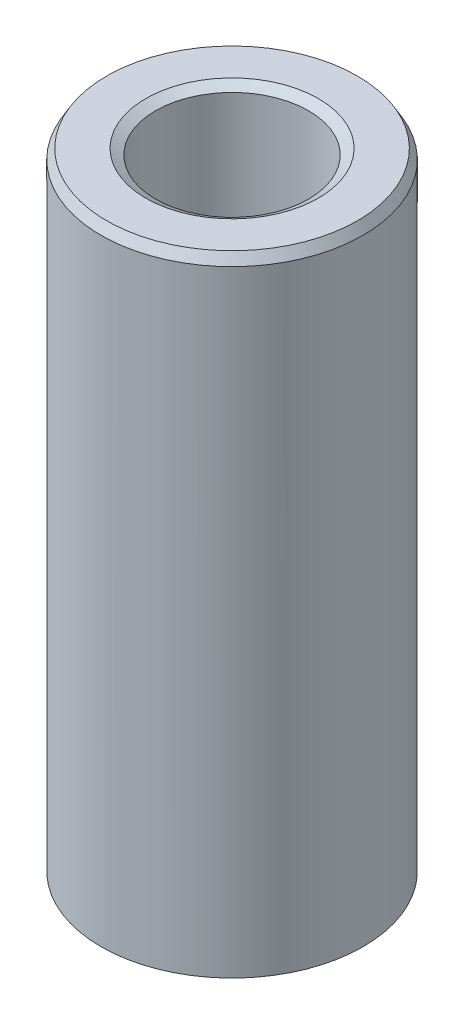
ISO-10303-21;
HEADER;
FILE_DESCRIPTION(('STEP AP214'),'2;1');
FILE_NAME('part.step','',(''),(''),'','','');
FILE_SCHEMA(('AUTOMOTIVE_DESIGN { 1 0 10303 214 1 1 1 1 }'));
ENDSEC;
DATA;
#1=APPLICATION_CONTEXT('core data for automotive mechanical design processes');
#2=APPLICATION_PROTOCOL_DEFINITION('international standard','automotive_design',2000,#1);
#3=PRODUCT_CONTEXT('',#1,'mechanical');
#4=PRODUCT('Part','Part','',(#3));
#5=PRODUCT_RELATED_PRODUCT_CATEGORY('part','',(#4));
#6=PRODUCT_DEFINITION_FORMATION('','',#4);
#7=PRODUCT_DEFINITION_CONTEXT('part definition',#1,'design');
#8=PRODUCT_DEFINITION('design','',#6,#7);
#9=PRODUCT_DEFINITION_SHAPE('','',#8);
#10=(LENGTH_UNIT() NAMED_UNIT(*) SI_UNIT(.MILLI.,.METRE.));
#11=(NAMED_UNIT(*) PLANE_ANGLE_UNIT() SI_UNIT($,.RADIAN.));
#12=(NAMED_UNIT(*) SI_UNIT($,.STERADIAN.) SOLID_ANGLE_UNIT());
#13=UNCERTAINTY_MEASURE_WITH_UNIT(LENGTH_MEASURE(1.E-05),#10,'distance_accuracy_value','');
#14=(GEOMETRIC_REPRESENTATION_CONTEXT(3) GLOBAL_UNCERTAINTY_ASSIGNED_CONTEXT((#13)) GLOBAL_UNIT_ASSIGNED_CONTEXT((#10,
#11,#12)) REPRESENTATION_CONTEXT('',''));
#15=CARTESIAN_POINT('',(0.,0.,0.));
#16=DIRECTION('',(0.,0.,1.));
#17=DIRECTION('',(1.,0.,0.));
#18=AXIS2_PLACEMENT_3D('',#15,#16,#17);
#19=CARTESIAN_POINT('',(0.,60.2453496191508,0.));
#20=DIRECTION('',(0.,-1.,0.));
#21=DIRECTION('',(0.,0.,-1.));
#22=AXIS2_PLACEMENT_3D('',#19,#20,#21);
#23=CYLINDRICAL_SURFACE('',#22,12.5);
#24=CARTESIAN_POINT('',(0.,0.538883833662865,0.));
#25=DIRECTION('',(0.,1.,0.));
#26=DIRECTION('',(0.,0.,1.));
#27=AXIS2_PLACEMENT_3D('',#24,#25,#26);
#28=CIRCLE('',#27,12.5);
#29=CARTESIAN_POINT('',(0.,0.538883833662865,12.5));
#30=VERTEX_POINT('',#29);
#31=EDGE_CURVE('E10',#30,#30,#28,.T.);
#32=ORIENTED_EDGE('',*,*,#31,.T.);
#33=EDGE_LOOP('',(#32));
#34=FACE_BOUND('',#33,.T.);
#35=CARTESIAN_POINT('',(0.,59.3119754398693,0.));
#36=DIRECTION('',(0.,1.,0.));
#37=DIRECTION('',(0.,0.,1.));
#38=AXIS2_PLACEMENT_3D('',#35,#36,#37);
#39=CIRCLE('',#38,12.5);
#40=CARTESIAN_POINT('',(0.,59.3119754398693,-12.5));
#41=VERTEX_POINT('',#40);
#42=EDGE_CURVE('E50',#41,#41,#39,.F.);
#43=ORIENTED_EDGE('',*,*,#42,.T.);
#44=EDGE_LOOP('',(#43));
#45=FACE_BOUND('',#44,.T.);
#46=ADVANCED_FACE('F39',(#34,#45),#23,.T.);
#47=CARTESIAN_POINT('',(0.,60.2453496191508,0.));
#48=DIRECTION('',(0.,1.,0.));
#49=DIRECTION('',(0.,0.,1.));
#50=AXIS2_PLACEMENT_3D('',#47,#48,#49);
#51=PLANE('',#50);
#52=CARTESIAN_POINT('',(0.,60.2453496191508,0.));
#53=DIRECTION('',(0.,1.,0.));
#54=DIRECTION('',(0.,0.,1.));
#55=AXIS2_PLACEMENT_3D('',#52,#53,#54);
#56=CIRCLE('',#55,8.2341659775638);
#57=CARTESIAN_POINT('',(0.,60.2453496191508,8.2341659775638));
#58=VERTEX_POINT('',#57);
#59=EDGE_CURVE('E58',#58,#58,#56,.F.);
#60=ORIENTED_EDGE('',*,*,#59,.T.);
#61=EDGE_LOOP('',(#60));
#62=FACE_BOUND('',#61,.T.);
#63=CARTESIAN_POINT('',(0.,60.2453496191508,0.));
#64=DIRECTION('',(0.,1.,0.));
#65=DIRECTION('',(0.,0.,1.));
#66=AXIS2_PLACEMENT_3D('',#63,#64,#65);
#67=CIRCLE('',#66,11.9611161663372);
#68=CARTESIAN_POINT('',(0.,60.2453496191508,-11.9611161663372));
#69=VERTEX_POINT('',#68);
#70=EDGE_CURVE('E61',#69,#69,#67,.T.);
#71=ORIENTED_EDGE('',*,*,#70,.T.);
#72=EDGE_LOOP('',(#71));
#73=FACE_BOUND('',#72,.T.);
#74=ADVANCED_FACE('F88',(#62,#73),#51,.T.);
#75=CARTESIAN_POINT('',(0.,0.,0.));
#76=DIRECTION('',(0.,1.,0.));
#77=DIRECTION('',(0.,0.,1.));
#78=AXIS2_PLACEMENT_3D('',#75,#76,#77);
#79=PLANE('',#78);
#80=CARTESIAN_POINT('',(0.,0.,0.));
#81=DIRECTION('',(0.,1.,0.));
#82=DIRECTION('',(0.,0.,1.));
#83=AXIS2_PLACEMENT_3D('',#80,#81,#82);
#84=CIRCLE('',#83,7.83967563194508);
#85=CARTESIAN_POINT('',(0.,0.,-7.83967563194508));
#86=VERTEX_POINT('',#85);
#87=EDGE_CURVE('E51',#86,#86,#84,.T.);
#88=ORIENTED_EDGE('',*,*,#87,.T.);
#89=EDGE_LOOP('',(#88));
#90=FACE_BOUND('',#89,.T.);
#91=CARTESIAN_POINT('',(0.,0.,0.));
#92=DIRECTION('',(0.,1.,0.));
#93=DIRECTION('',(0.,0.,1.));
#94=AXIS2_PLACEMENT_3D('',#91,#92,#93);
#95=CIRCLE('',#94,11.5666258207184);
#96=CARTESIAN_POINT('',(0.,0.,11.5666258207184));
#97=VERTEX_POINT('',#96);
#98=EDGE_CURVE('E54',#97,#97,#95,.F.);
#99=ORIENTED_EDGE('',*,*,#98,.T.);
#100=EDGE_LOOP('',(#99));
#101=FACE_BOUND('',#100,.T.);
#102=ADVANCED_FACE('F83',(#90,#101),#79,.F.);
#103=CARTESIAN_POINT('',(0.,60.2453496191508,0.));
#104=DIRECTION('',(0.,-1.,0.));
#105=DIRECTION('',(0.,0.,-1.));
#106=AXIS2_PLACEMENT_3D('',#103,#104,#105);
#107=CYLINDRICAL_SURFACE('',#106,7.30079179828223);
#108=CARTESIAN_POINT('',(0.,59.706465785488,0.));
#109=DIRECTION('',(0.,1.,0.));
#110=DIRECTION('',(0.,0.,1.));
#111=AXIS2_PLACEMENT_3D('',#108,#109,#110);
#112=CIRCLE('',#111,7.30079179828223);
#113=CARTESIAN_POINT('',(0.,59.706465785488,7.30079179828223));
#114=VERTEX_POINT('',#113);
#115=EDGE_CURVE('E67',#114,#114,#112,.T.);
#116=ORIENTED_EDGE('',*,*,#115,.T.);
#117=EDGE_LOOP('',(#116));
#118=FACE_BOUND('',#117,.T.);
#119=CARTESIAN_POINT('',(0.,0.93337417928157,0.));
#120=DIRECTION('',(0.,1.,0.));
#121=DIRECTION('',(0.,0.,1.));
#122=AXIS2_PLACEMENT_3D('',#119,#120,#121);
#123=CIRCLE('',#122,7.30079179828223);
#124=CARTESIAN_POINT('',(0.,0.933374179281569,-7.30079179828223));
#125=VERTEX_POINT('',#124);
#126=EDGE_CURVE('E69',#125,#125,#123,.F.);
#127=ORIENTED_EDGE('',*,*,#126,.T.);
#128=EDGE_LOOP('',(#127));
#129=FACE_BOUND('',#128,.T.);
#130=ADVANCED_FACE('F71',(#118,#129),#107,.F.);
#131=CARTESIAN_POINT('',(0.,59.706465785488,0.));
#132=DIRECTION('',(0.,1.,0.));
#133=DIRECTION('',(0.,0.,1.));
#134=AXIS2_PLACEMENT_3D('',#131,#132,#133);
#135=CONICAL_SURFACE('',#134,7.30079179828223,1.04719755119659);
#136=ORIENTED_EDGE('',*,*,#59,.F.);
#137=EDGE_LOOP('',(#136));
#138=FACE_BOUND('',#137,.T.);
#139=ORIENTED_EDGE('',*,*,#115,.F.);
#140=EDGE_LOOP('',(#139));
#141=FACE_BOUND('',#140,.T.);
#142=ADVANCED_FACE('F77',(#138,#141),#135,.F.);
#143=CARTESIAN_POINT('',(0.,0.,0.));
#144=DIRECTION('',(0.,-1.,0.));
#145=DIRECTION('',(0.,0.,-1.));
#146=AXIS2_PLACEMENT_3D('',#143,#144,#145);
#147=CONICAL_SURFACE('',#146,7.83967563194508,0.523598775598292);
#148=CARTESIAN_POINT('',(0.,0.933374179281569,-7.30079179828223));
#149=CARTESIAN_POINT('',(0.,0.92365153158072,-7.30640517154955));
#150=CARTESIAN_POINT('',(0.,0.91392888387987,-7.31201854481687));
#151=CARTESIAN_POINT('',(0.,0.894483588478171,-7.32324529135151));
#152=CARTESIAN_POINT('',(0.,0.884760940777321,-7.32885866461883));
#153=CARTESIAN_POINT('',(0.,0.865315645375622,-7.34008541115348));
#154=CARTESIAN_POINT('',(0.,0.855592997674772,-7.3456987844208));
#155=CARTESIAN_POINT('',(0.,0.836147702273073,-7.35692553095544));
#156=CARTESIAN_POINT('',(0.,0.826425054572223,-7.36253890422276));
#157=CARTESIAN_POINT('',(0.,0.806979759170524,-7.37376565075741));
#158=CARTESIAN_POINT('',(0.,0.797257111469674,-7.37937902402473));
#159=CARTESIAN_POINT('',(0.,0.777811816067974,-7.39060577055937));
#160=CARTESIAN_POINT('',(0.,0.768089168367125,-7.39621914382669));
#161=CARTESIAN_POINT('',(0.,0.748643872965425,-7.40744589036133));
#162=CARTESIAN_POINT('',(0.,0.738921225264576,-7.41305926362866));
#163=CARTESIAN_POINT('',(0.,0.719475929862876,-7.4242860101633));
#164=CARTESIAN_POINT('',(0.,0.709753282162027,-7.42989938343062));
#165=CARTESIAN_POINT('',(0.,0.690307986760327,-7.44112612996526));
#166=CARTESIAN_POINT('',(0.,0.680585339059478,-7.44673950323258));
#167=CARTESIAN_POINT('',(0.,0.661140043657778,-7.45796624976723));
#168=CARTESIAN_POINT('',(0.,0.651417395956928,-7.46357962303455));
#169=CARTESIAN_POINT('',(0.,0.631972100555229,-7.47480636956919));
#170=CARTESIAN_POINT('',(0.,0.622249452854379,-7.48041974283651));
#171=CARTESIAN_POINT('',(0.,0.60280415745268,-7.49164648937115));
#172=CARTESIAN_POINT('',(0.,0.59308150975183,-7.49725986263848));
#173=CARTESIAN_POINT('',(0.,0.573636214350131,-7.50848660917312));
#174=CARTESIAN_POINT('',(0.,0.563913566649281,-7.51409998244044));
#175=CARTESIAN_POINT('',(0.,0.544468271247582,-7.52532672897508));
#176=CARTESIAN_POINT('',(0.,0.534745623546732,-7.5309401022424));
#177=CARTESIAN_POINT('',(0.,0.515300328145033,-7.54216684877705));
#178=CARTESIAN_POINT('',(0.,0.505577680444183,-7.54778022204437));
#179=CARTESIAN_POINT('',(0.,0.486132385042484,-7.55900696857901));
#180=CARTESIAN_POINT('',(0.,0.476409737341634,-7.56462034184633));
#181=CARTESIAN_POINT('',(0.,0.456964441939935,-7.57584708838098));
#182=CARTESIAN_POINT('',(0.,0.447241794239085,-7.5814604616483));
#183=CARTESIAN_POINT('',(0.,0.427796498837386,-7.59268720818294));
#184=CARTESIAN_POINT('',(0.,0.418073851136536,-7.59830058145026));
#185=CARTESIAN_POINT('',(0.,0.398628555734837,-7.6095273279849));
#186=CARTESIAN_POINT('',(0.,0.388905908033987,-7.61514070125223));
#187=CARTESIAN_POINT('',(0.,0.369460612632288,-7.62636744778687));
#188=CARTESIAN_POINT('',(0.,0.359737964931438,-7.63198082105419));
#189=CARTESIAN_POINT('',(0.,0.340292669529739,-7.64320756758883));
#190=CARTESIAN_POINT('',(0.,0.330570021828889,-7.64882094085615));
#191=CARTESIAN_POINT('',(0.,0.31112472642719,-7.6600476873908));
#192=CARTESIAN_POINT('',(0.,0.30140207872634,-7.66566106065812));
#193=CARTESIAN_POINT('',(0.,0.281956783324641,-7.67688780719276));
#194=CARTESIAN_POINT('',(0.,0.272234135623791,-7.68250118046008));
#195=CARTESIAN_POINT('',(0.,0.252788840222092,-7.69372792699472));
#196=CARTESIAN_POINT('',(0.,0.243066192521242,-7.69934130026205));
#197=CARTESIAN_POINT('',(0.,0.223620897119543,-7.71056804679669));
#198=CARTESIAN_POINT('',(0.,0.213898249418693,-7.71618142006401));
#199=CARTESIAN_POINT('',(0.,0.194452954016994,-7.72740816659865));
#200=CARTESIAN_POINT('',(0.,0.184730306316144,-7.73302153986597));
#201=CARTESIAN_POINT('',(0.,0.165285010914445,-7.74424828640062));
#202=CARTESIAN_POINT('',(0.,0.155562363213595,-7.74986165966794));
#203=CARTESIAN_POINT('',(0.,0.136117067811896,-7.76108840620258));
#204=CARTESIAN_POINT('',(0.,0.126394420111046,-7.7667017794699));
#205=CARTESIAN_POINT('',(0.,0.106949124709346,-7.77792852600454));
#206=CARTESIAN_POINT('',(0.,0.0972264770084968,-7.78354189927187));
#207=CARTESIAN_POINT('',(0.,0.0777811816067974,-7.79476864580651));
#208=CARTESIAN_POINT('',(0.,0.0680585339059478,-7.80038201907383));
#209=CARTESIAN_POINT('',(0.,0.0486132385042484,-7.81160876560847));
#210=CARTESIAN_POINT('',(0.,0.0388905908033987,-7.81722213887579));
#211=CARTESIAN_POINT('',(0.,0.0194452954016994,-7.82844888541044));
#212=CARTESIAN_POINT('',(0.,0.00972264770084967,-7.83406225867776));
#213=CARTESIAN_POINT('',(0.,0.,-7.83967563194508));
#214=B_SPLINE_CURVE_WITH_KNOTS('',3,(#148,#149,#150,#151,#152,#153,#154,#155,#156,#157,#158,
#159,#160,#161,#162,#163,#164,#165,#166,#167,#168,#169,#170,#171,#172,#173,#174,#175,#176,#177,
#178,#179,#180,#181,#182,#183,#184,#185,#186,#187,#188,#189,#190,#191,#192,#193,#194,#195,#196,
#197,#198,#199,#200,#201,#202,#203,#204,#205,#206,#207,#208,#209,#210,#211,#212,#213),
.UNSPECIFIED.,.F.,.F.,(4,2,2,2,2,2,2,2,2,2,2,2,2,2,2,2,2,2,2,2,2,2,2,2,2,2,2,2,2,2,2,2,4),(0.,
0.0336802396039286,0.0673604792078572,0.101040718811786,0.134720958415714,0.168401198019643,
0.202081437623572,0.2357616772275,0.269441916831429,0.303122156435358,0.336802396039286,
0.370482635643215,0.404162875247143,0.437843114851072,0.471523354455001,0.50520359405893,
0.538883833662858,0.572564073266787,0.606244312870716,0.639924552474644,0.673604792078573,
0.707285031682501,0.74096527128643,0.774645510890359,0.808325750494287,0.842005990098216,
0.875686229702144,0.909366469306073,0.943046708910002,0.97672694851393,1.01040718811786,
1.04408742772179,1.07776766732572),.UNSPECIFIED.);
#215=EDGE_CURVE('BSEAM73',#125,#86,#214,.T.);
#216=ORIENTED_EDGE('',*,*,#126,.F.);
#217=ORIENTED_EDGE('',*,*,#87,.F.);
#218=ORIENTED_EDGE('',*,*,#215,.T.);
#219=ORIENTED_EDGE('',*,*,#215,.F.);
#220=EDGE_LOOP('',(#216,#218,#217,#219));
#221=FACE_BOUND('',#220,.T.);
#222=ADVANCED_FACE('F73',(#221),#147,.F.);
#223=CARTESIAN_POINT('',(0.,0.538883833662865,0.));
#224=DIRECTION('',(0.,1.,0.));
#225=DIRECTION('',(0.,0.,1.));
#226=AXIS2_PLACEMENT_3D('',#223,#224,#225);
#227=CONICAL_SURFACE('',#226,12.5,1.0471975511966);
#228=ORIENTED_EDGE('',*,*,#98,.F.);
#229=EDGE_LOOP('',(#228));
#230=FACE_BOUND('',#229,.T.);
#231=ORIENTED_EDGE('',*,*,#31,.F.);
#232=EDGE_LOOP('',(#231));
#233=FACE_BOUND('',#232,.T.);
#234=ADVANCED_FACE('F76',(#230,#233),#227,.T.);
#235=CARTESIAN_POINT('',(0.,60.2453496191508,0.));
#236=DIRECTION('',(0.,-1.,0.));
#237=DIRECTION('',(0.,0.,-1.));
#238=AXIS2_PLACEMENT_3D('',#235,#236,#237);
#239=CONICAL_SURFACE('',#238,11.9611161663372,0.523598775598295);
#240=CARTESIAN_POINT('',(0.,59.3119754398693,-12.5));
#241=CARTESIAN_POINT('',(0.,59.3216980875701,-12.4943866267327));
#242=CARTESIAN_POINT('',(0.,59.331420735271,-12.4887732534654));
#243=CARTESIAN_POINT('',(0.,59.3508660306727,-12.4775465069307));
#244=CARTESIAN_POINT('',(0.,59.3605886783735,-12.4719331336634));
#245=CARTESIAN_POINT('',(0.,59.3800339737752,-12.4607063871288));
#246=CARTESIAN_POINT('',(0.,59.3897566214761,-12.4550930138614));
#247=CARTESIAN_POINT('',(0.,59.4092019168778,-12.4438662673268));
#248=CARTESIAN_POINT('',(0.,59.4189245645786,-12.4382528940595));
#249=CARTESIAN_POINT('',(0.,59.4383698599803,-12.4270261475248));
#250=CARTESIAN_POINT('',(0.,59.4480925076812,-12.4214127742575));
#251=CARTESIAN_POINT('',(0.,59.4675378030829,-12.4101860277229));
#252=CARTESIAN_POINT('',(0.,59.4772604507837,-12.4045726544555));
#253=CARTESIAN_POINT('',(0.,59.4967057461854,-12.3933459079209));
#254=CARTESIAN_POINT('',(0.,59.5064283938863,-12.3877325346536));
#255=CARTESIAN_POINT('',(0.,59.525873689288,-12.3765057881189));
#256=CARTESIAN_POINT('',(0.,59.5355963369888,-12.3708924148516));
#257=CARTESIAN_POINT('',(0.,59.5550416323905,-12.359665668317));
#258=CARTESIAN_POINT('',(0.,59.5647642800914,-12.3540522950496));
#259=CARTESIAN_POINT('',(0.,59.584209575493,-12.342825548515));
#260=CARTESIAN_POINT('',(0.,59.5939322231939,-12.3372121752477));
#261=CARTESIAN_POINT('',(0.,59.6133775185956,-12.325985428713));
#262=CARTESIAN_POINT('',(0.,59.6231001662965,-12.3203720554457));
#263=CARTESIAN_POINT('',(0.,59.6425454616981,-12.3091453089111));
#264=CARTESIAN_POINT('',(0.,59.652268109399,-12.3035319356438));
#265=CARTESIAN_POINT('',(0.,59.6717134048007,-12.2923051891091));
#266=CARTESIAN_POINT('',(0.,59.6814360525015,-12.2866918158418));
#267=CARTESIAN_POINT('',(0.,59.7008813479032,-12.2754650693071));
#268=CARTESIAN_POINT('',(0.,59.7106039956041,-12.2698516960398));
#269=CARTESIAN_POINT('',(0.,59.7300492910058,-12.2586249495052));
#270=CARTESIAN_POINT('',(0.,59.7397719387066,-12.2530115762379));
#271=CARTESIAN_POINT('',(0.,59.7592172341083,-12.2417848297032));
#272=CARTESIAN_POINT('',(0.,59.7689398818092,-12.2361714564359));
#273=CARTESIAN_POINT('',(0.,59.7883851772109,-12.2249447099013));
#274=CARTESIAN_POINT('',(0.,59.7981078249117,-12.2193313366339));
#275=CARTESIAN_POINT('',(0.,59.8175531203134,-12.2081045900993));
#276=CARTESIAN_POINT('',(0.,59.8272757680143,-12.202491216832));
#277=CARTESIAN_POINT('',(0.,59.846721063416,-12.1912644702973));
#278=CARTESIAN_POINT('',(0.,59.8564437111168,-12.18565109703));
#279=CARTESIAN_POINT('',(0.,59.8758890065185,-12.1744243504954));
#280=CARTESIAN_POINT('',(0.,59.8856116542194,-12.168810977228));
#281=CARTESIAN_POINT('',(0.,59.9050569496211,-12.1575842306934));
#282=CARTESIAN_POINT('',(0.,59.9147795973219,-12.1519708574261));
#283=CARTESIAN_POINT('',(0.,59.9342248927236,-12.1407441108914));
#284=CARTESIAN_POINT('',(0.,59.9439475404245,-12.1351307376241));
#285=CARTESIAN_POINT('',(0.,59.9633928358262,-12.1239039910895));
#286=CARTESIAN_POINT('',(0.,59.973115483527,-12.1182906178222));
#287=CARTESIAN_POINT('',(0.,59.9925607789287,-12.1070638712875));
#288=CARTESIAN_POINT('',(0.,60.0022834266296,-12.1014504980202));
#289=CARTESIAN_POINT('',(0.,60.0217287220313,-12.0902237514855));
#290=CARTESIAN_POINT('',(0.,60.0314513697321,-12.0846103782182));
#291=CARTESIAN_POINT('',(0.,60.0508966651338,-12.0733836316836));
#292=CARTESIAN_POINT('',(0.,60.0606193128347,-12.0677702584163));
#293=CARTESIAN_POINT('',(0.,60.0800646082364,-12.0565435118816));
#294=CARTESIAN_POINT('',(0.,60.0897872559372,-12.0509301386143));
#295=CARTESIAN_POINT('',(0.,60.1092325513389,-12.0397033920797));
#296=CARTESIAN_POINT('',(0.,60.1189551990398,-12.0340900188123));
#297=CARTESIAN_POINT('',(0.,60.1384004944415,-12.0228632722777));
#298=CARTESIAN_POINT('',(0.,60.1481231421423,-12.0172498990104));
#299=CARTESIAN_POINT('',(0.,60.167568437544,-12.0060231524757));
#300=CARTESIAN_POINT('',(0.,60.1772910852449,-12.0004097792084));
#301=CARTESIAN_POINT('',(0.,60.1967363806466,-11.9891830326738));
#302=CARTESIAN_POINT('',(0.,60.2064590283474,-11.9835696594064));
#303=CARTESIAN_POINT('',(0.,60.2259043237491,-11.9723429128718));
#304=CARTESIAN_POINT('',(0.,60.23562697145,-11.9667295396045));
#305=CARTESIAN_POINT('',(0.,60.2453496191508,-11.9611161663372));
#306=B_SPLINE_CURVE_WITH_KNOTS('',3,(#240,#241,#242,#243,#244,#245,#246,#247,#248,#249,#250,
#251,#252,#253,#254,#255,#256,#257,#258,#259,#260,#261,#262,#263,#264,#265,#266,#267,#268,#269,
#270,#271,#272,#273,#274,#275,#276,#277,#278,#279,#280,#281,#282,#283,#284,#285,#286,#287,#288,
#289,#290,#291,#292,#293,#294,#295,#296,#297,#298,#299,#300,#301,#302,#303,#304,#305),
.UNSPECIFIED.,.F.,.F.,(4,2,2,2,2,2,2,2,2,2,2,2,2,2,2,2,2,2,2,2,2,2,2,2,2,2,2,2,2,2,2,2,4),(0.,
0.0336802396039303,0.0673604792078606,0.101040718811785,0.134720958415714,0.168401198019645,
0.202081437623569,0.235761677227499,0.26944191683143,0.303122156435354,0.336802396039284,
0.370482635643214,0.404162875247139,0.437843114851069,0.471523354454999,0.505203594058924,
0.538883833662854,0.572564073266784,0.606244312870709,0.639924552474639,0.673604792078569,
0.707285031682493,0.740965271286423,0.774645510890353,0.808325750494278,0.842005990098208,
0.875686229702138,0.909366469306063,0.943046708909993,0.976726948513923,1.01040718811785,
1.04408742772178,1.07776766732571),.UNSPECIFIED.);
#307=EDGE_CURVE('BSEAM45',#41,#69,#306,.T.);
#308=ORIENTED_EDGE('',*,*,#42,.F.);
#309=ORIENTED_EDGE('',*,*,#70,.F.);
#310=ORIENTED_EDGE('',*,*,#307,.T.);
#311=ORIENTED_EDGE('',*,*,#307,.F.);
#312=EDGE_LOOP('',(#308,#310,#309,#311));
#313=FACE_BOUND('',#312,.T.);
#314=ADVANCED_FACE('F45',(#313),#239,.T.);
#315=CLOSED_SHELL('',(#46,#74,#102,#130,#142,#222,#234,#314));
#316=MANIFOLD_SOLID_BREP('B2',#315);
#317=ADVANCED_BREP_SHAPE_REPRESENTATION('',(#18,#316),#14);
#318=SHAPE_DEFINITION_REPRESENTATION(#9,#317);
ENDSEC;
END-ISO-10303-21;
